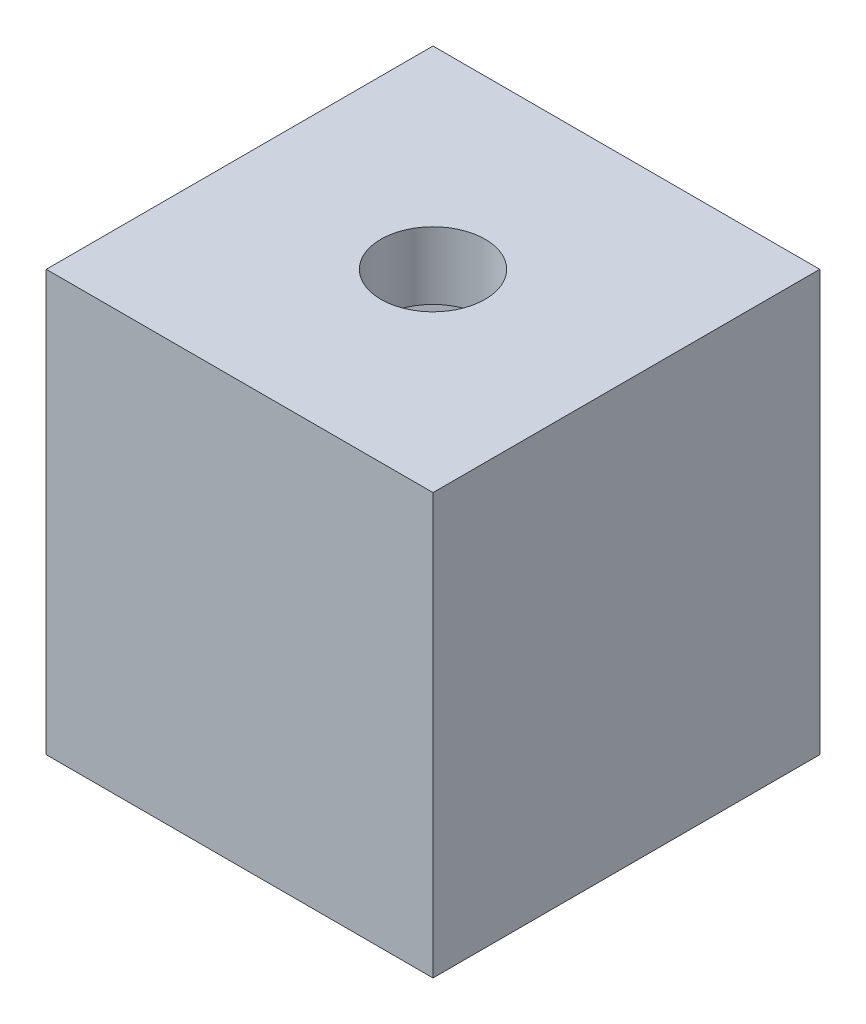
ISO-10303-21;
HEADER;
FILE_DESCRIPTION(('STEP AP214'),'2;1');
FILE_NAME('part.step','',(''),(''),'','','');
FILE_SCHEMA(('AUTOMOTIVE_DESIGN { 1 0 10303 214 1 1 1 1 }'));
ENDSEC;
DATA;
#1=APPLICATION_CONTEXT('core data for automotive mechanical design processes');
#2=APPLICATION_PROTOCOL_DEFINITION('international standard','automotive_design',2000,#1);
#3=PRODUCT_CONTEXT('',#1,'mechanical');
#4=PRODUCT('Part','Part','',(#3));
#5=PRODUCT_RELATED_PRODUCT_CATEGORY('part','',(#4));
#6=PRODUCT_DEFINITION_FORMATION('','',#4);
#7=PRODUCT_DEFINITION_CONTEXT('part definition',#1,'design');
#8=PRODUCT_DEFINITION('design','',#6,#7);
#9=PRODUCT_DEFINITION_SHAPE('','',#8);
#10=(LENGTH_UNIT() NAMED_UNIT(*) SI_UNIT(.MILLI.,.METRE.));
#11=(NAMED_UNIT(*) PLANE_ANGLE_UNIT() SI_UNIT($,.RADIAN.));
#12=(NAMED_UNIT(*) SI_UNIT($,.STERADIAN.) SOLID_ANGLE_UNIT());
#13=UNCERTAINTY_MEASURE_WITH_UNIT(LENGTH_MEASURE(1.E-05),#10,'distance_accuracy_value','');
#14=(GEOMETRIC_REPRESENTATION_CONTEXT(3) GLOBAL_UNCERTAINTY_ASSIGNED_CONTEXT((#13)) GLOBAL_UNIT_ASSIGNED_CONTEXT((#10,
#11,#12)) REPRESENTATION_CONTEXT('',''));
#15=CARTESIAN_POINT('',(0.,0.,0.));
#16=DIRECTION('',(0.,0.,1.));
#17=DIRECTION('',(1.,0.,0.));
#18=AXIS2_PLACEMENT_3D('',#15,#16,#17);
#19=CARTESIAN_POINT('',(-5.75,12.5,-5.75));
#20=DIRECTION('',(0.,0.,-1.));
#21=DIRECTION('',(-1.,0.,0.));
#22=AXIS2_PLACEMENT_3D('',#19,#20,#21);
#23=PLANE('',#22);
#24=DIRECTION('',(1.,0.,0.));
#25=VECTOR('',#24,1.);
#26=CARTESIAN_POINT('',(-5.75,0.,-5.75));
#27=LINE('',#26,#25);
#28=CARTESIAN_POINT('',(-5.75,0.,-5.75));
#29=VERTEX_POINT('',#28);
#30=CARTESIAN_POINT('',(5.75,0.,-5.75));
#31=VERTEX_POINT('',#30);
#32=EDGE_CURVE('E167',#29,#31,#27,.T.);
#33=ORIENTED_EDGE('',*,*,#32,.F.);
#34=DIRECTION('',(0.,-1.,0.));
#35=VECTOR('',#34,1.);
#36=CARTESIAN_POINT('',(-5.75,12.5,-5.75));
#37=LINE('',#36,#35);
#38=CARTESIAN_POINT('',(-5.75,12.5,-5.75));
#39=VERTEX_POINT('',#38);
#40=EDGE_CURVE('E11',#39,#29,#37,.T.);
#41=ORIENTED_EDGE('',*,*,#40,.F.);
#42=DIRECTION('',(1.,0.,0.));
#43=VECTOR('',#42,1.);
#44=CARTESIAN_POINT('',(-5.75,12.5,-5.75));
#45=LINE('',#44,#43);
#46=CARTESIAN_POINT('',(5.75,12.5,-5.75));
#47=VERTEX_POINT('',#46);
#48=EDGE_CURVE('E170',#39,#47,#45,.T.);
#49=ORIENTED_EDGE('',*,*,#48,.T.);
#50=DIRECTION('',(0.,-1.,0.));
#51=VECTOR('',#50,1.);
#52=CARTESIAN_POINT('',(5.75,12.5,-5.75));
#53=LINE('',#52,#51);
#54=EDGE_CURVE('E42',#47,#31,#53,.T.);
#55=ORIENTED_EDGE('',*,*,#54,.T.);
#56=EDGE_LOOP('',(#33,#41,#49,#55));
#57=FACE_BOUND('',#56,.T.);
#58=ADVANCED_FACE('F39',(#57),#23,.T.);
#59=CARTESIAN_POINT('',(-5.75,12.5,5.75));
#60=DIRECTION('',(-1.,0.,0.));
#61=DIRECTION('',(0.,0.,1.));
#62=AXIS2_PLACEMENT_3D('',#59,#60,#61);
#63=PLANE('',#62);
#64=DIRECTION('',(0.,1.,0.));
#65=VECTOR('',#64,1.);
#66=CARTESIAN_POINT('',(-5.75,0.,-2.65));
#67=LINE('',#66,#65);
#68=CARTESIAN_POINT('',(-5.75,0.,-2.65));
#69=VERTEX_POINT('',#68);
#70=CARTESIAN_POINT('',(-5.75,10.5,-2.65));
#71=VERTEX_POINT('',#70);
#72=EDGE_CURVE('E121',#69,#71,#67,.T.);
#73=ORIENTED_EDGE('',*,*,#72,.T.);
#74=DIRECTION('',(0.,0.,1.));
#75=VECTOR('',#74,1.);
#76=CARTESIAN_POINT('',(-5.75,10.5,2.65));
#77=LINE('',#76,#75);
#78=CARTESIAN_POINT('',(-5.75,10.5,2.65));
#79=VERTEX_POINT('',#78);
#80=EDGE_CURVE('E130',#71,#79,#77,.T.);
#81=ORIENTED_EDGE('',*,*,#80,.T.);
#82=DIRECTION('',(0.,-1.,0.));
#83=VECTOR('',#82,1.);
#84=CARTESIAN_POINT('',(-5.75,0.,2.65));
#85=LINE('',#84,#83);
#86=CARTESIAN_POINT('',(-5.75,0.,2.65));
#87=VERTEX_POINT('',#86);
#88=EDGE_CURVE('E137',#79,#87,#85,.T.);
#89=ORIENTED_EDGE('',*,*,#88,.T.);
#90=DIRECTION('',(0.,0.,-1.));
#91=VECTOR('',#90,1.);
#92=CARTESIAN_POINT('',(-5.75,0.,5.75));
#93=LINE('',#92,#91);
#94=CARTESIAN_POINT('',(-5.75,0.,5.75));
#95=VERTEX_POINT('',#94);
#96=EDGE_CURVE('E172',#95,#87,#93,.T.);
#97=ORIENTED_EDGE('',*,*,#96,.F.);
#98=DIRECTION('',(0.,-1.,0.));
#99=VECTOR('',#98,1.);
#100=CARTESIAN_POINT('',(-5.75,12.5,5.75));
#101=LINE('',#100,#99);
#102=CARTESIAN_POINT('',(-5.75,12.5,5.75));
#103=VERTEX_POINT('',#102);
#104=EDGE_CURVE('E47',#103,#95,#101,.T.);
#105=ORIENTED_EDGE('',*,*,#104,.F.);
#106=DIRECTION('',(0.,0.,-1.));
#107=VECTOR('',#106,1.);
#108=CARTESIAN_POINT('',(-5.75,12.5,5.75));
#109=LINE('',#108,#107);
#110=EDGE_CURVE('E176',#103,#39,#109,.T.);
#111=ORIENTED_EDGE('',*,*,#110,.T.);
#112=ORIENTED_EDGE('',*,*,#40,.T.);
#113=EDGE_CURVE('E84',#69,#29,#93,.T.);
#114=ORIENTED_EDGE('',*,*,#113,.F.);
#115=EDGE_LOOP('',(#73,#81,#89,#97,#105,#111,#112,#114));
#116=FACE_BOUND('',#115,.T.);
#117=ADVANCED_FACE('F139',(#116),#63,.T.);
#118=CARTESIAN_POINT('',(-5.75,12.5,5.75));
#119=DIRECTION('',(0.,0.,-1.));
#120=DIRECTION('',(-1.,0.,0.));
#121=AXIS2_PLACEMENT_3D('',#118,#119,#120);
#122=PLANE('',#121);
#123=DIRECTION('',(1.,0.,0.));
#124=VECTOR('',#123,1.);
#125=CARTESIAN_POINT('',(-5.75,0.,5.75));
#126=LINE('',#125,#124);
#127=CARTESIAN_POINT('',(5.75,0.,5.75));
#128=VERTEX_POINT('',#127);
#129=EDGE_CURVE('E183',#95,#128,#126,.T.);
#130=ORIENTED_EDGE('',*,*,#129,.T.);
#131=DIRECTION('',(0.,-1.,0.));
#132=VECTOR('',#131,1.);
#133=CARTESIAN_POINT('',(5.75,12.5,5.75));
#134=LINE('',#133,#132);
#135=CARTESIAN_POINT('',(5.75,12.5,5.75));
#136=VERTEX_POINT('',#135);
#137=EDGE_CURVE('E187',#136,#128,#134,.T.);
#138=ORIENTED_EDGE('',*,*,#137,.F.);
#139=DIRECTION('',(1.,0.,0.));
#140=VECTOR('',#139,1.);
#141=CARTESIAN_POINT('',(-5.75,12.5,5.75));
#142=LINE('',#141,#140);
#143=EDGE_CURVE('E174',#103,#136,#142,.T.);
#144=ORIENTED_EDGE('',*,*,#143,.F.);
#145=ORIENTED_EDGE('',*,*,#104,.T.);
#146=EDGE_LOOP('',(#130,#138,#144,#145));
#147=FACE_BOUND('',#146,.T.);
#148=ADVANCED_FACE('F213',(#147),#122,.F.);
#149=CARTESIAN_POINT('',(5.75,12.5,5.75));
#150=DIRECTION('',(-1.,0.,0.));
#151=DIRECTION('',(0.,0.,1.));
#152=AXIS2_PLACEMENT_3D('',#149,#150,#151);
#153=PLANE('',#152);
#154=DIRECTION('',(0.,0.,-1.));
#155=VECTOR('',#154,1.);
#156=CARTESIAN_POINT('',(5.75,0.,5.75));
#157=LINE('',#156,#155);
#158=EDGE_CURVE('E180',#128,#31,#157,.T.);
#159=ORIENTED_EDGE('',*,*,#158,.T.);
#160=ORIENTED_EDGE('',*,*,#54,.F.);
#161=DIRECTION('',(0.,0.,-1.));
#162=VECTOR('',#161,1.);
#163=CARTESIAN_POINT('',(5.75,12.5,5.75));
#164=LINE('',#163,#162);
#165=EDGE_CURVE('E90',#136,#47,#164,.T.);
#166=ORIENTED_EDGE('',*,*,#165,.F.);
#167=ORIENTED_EDGE('',*,*,#137,.T.);
#168=EDGE_LOOP('',(#159,#160,#166,#167));
#169=FACE_BOUND('',#168,.T.);
#170=ADVANCED_FACE('F192',(#169),#153,.F.);
#171=CARTESIAN_POINT('',(0.,12.5,0.));
#172=DIRECTION('',(0.,1.,0.));
#173=DIRECTION('',(0.,0.,1.));
#174=AXIS2_PLACEMENT_3D('',#171,#172,#173);
#175=PLANE('',#174);
#176=CARTESIAN_POINT('',(0.,12.5,0.));
#177=DIRECTION('',(0.,1.,0.));
#178=DIRECTION('',(0.,0.,1.));
#179=AXIS2_PLACEMENT_3D('',#176,#177,#178);
#180=CIRCLE('',#179,1.55);
#181=CARTESIAN_POINT('',(0.,12.5,1.55));
#182=VERTEX_POINT('',#181);
#183=EDGE_CURVE('E164',#182,#182,#180,.T.);
#184=ORIENTED_EDGE('',*,*,#183,.F.);
#185=EDGE_LOOP('',(#184));
#186=FACE_BOUND('',#185,.T.);
#187=ORIENTED_EDGE('',*,*,#48,.F.);
#188=ORIENTED_EDGE('',*,*,#110,.F.);
#189=ORIENTED_EDGE('',*,*,#143,.T.);
#190=ORIENTED_EDGE('',*,*,#165,.T.);
#191=EDGE_LOOP('',(#187,#188,#189,#190));
#192=FACE_BOUND('',#191,.T.);
#193=ADVANCED_FACE('F197',(#186,#192),#175,.T.);
#194=CARTESIAN_POINT('',(0.,0.,0.));
#195=DIRECTION('',(0.,1.,0.));
#196=DIRECTION('',(0.,0.,1.));
#197=AXIS2_PLACEMENT_3D('',#194,#195,#196);
#198=PLANE('',#197);
#199=DIRECTION('',(-1.,0.,0.));
#200=VECTOR('',#199,1.);
#201=CARTESIAN_POINT('',(1.52997821335251,0.,-2.65));
#202=LINE('',#201,#200);
#203=CARTESIAN_POINT('',(1.52997821335251,0.,-2.65));
#204=VERTEX_POINT('',#203);
#205=EDGE_CURVE('E55',#204,#69,#202,.T.);
#206=ORIENTED_EDGE('',*,*,#205,.T.);
#207=ORIENTED_EDGE('',*,*,#113,.T.);
#208=ORIENTED_EDGE('',*,*,#32,.T.);
#209=ORIENTED_EDGE('',*,*,#158,.F.);
#210=ORIENTED_EDGE('',*,*,#129,.F.);
#211=ORIENTED_EDGE('',*,*,#96,.T.);
#212=DIRECTION('',(1.,0.,0.));
#213=VECTOR('',#212,1.);
#214=CARTESIAN_POINT('',(-1.52997821335251,0.,2.65));
#215=LINE('',#214,#213);
#216=CARTESIAN_POINT('',(1.52997821335251,0.,2.65));
#217=VERTEX_POINT('',#216);
#218=EDGE_CURVE('E151',#87,#217,#215,.T.);
#219=ORIENTED_EDGE('',*,*,#218,.T.);
#220=DIRECTION('',(0.5,0.,-0.866025403784439));
#221=VECTOR('',#220,1.);
#222=CARTESIAN_POINT('',(1.52997821335251,0.,2.65));
#223=LINE('',#222,#221);
#224=CARTESIAN_POINT('',(3.05995642670502,0.,0.));
#225=VERTEX_POINT('',#224);
#226=EDGE_CURVE('E144',#217,#225,#223,.T.);
#227=ORIENTED_EDGE('',*,*,#226,.T.);
#228=DIRECTION('',(-0.5,0.,-0.866025403784438));
#229=VECTOR('',#228,1.);
#230=CARTESIAN_POINT('',(3.05995642670502,0.,0.));
#231=LINE('',#230,#229);
#232=EDGE_CURVE('E147',#225,#204,#231,.T.);
#233=ORIENTED_EDGE('',*,*,#232,.T.);
#234=EDGE_LOOP('',(#206,#207,#208,#209,#210,#211,#219,#227,#233));
#235=FACE_BOUND('',#234,.T.);
#236=ADVANCED_FACE('F194',(#235),#198,.F.);
#237=CARTESIAN_POINT('',(0.,12.5,0.));
#238=DIRECTION('',(0.,-1.,0.));
#239=DIRECTION('',(0.,0.,-1.));
#240=AXIS2_PLACEMENT_3D('',#237,#238,#239);
#241=CYLINDRICAL_SURFACE('',#240,1.55);
#242=ORIENTED_EDGE('',*,*,#183,.T.);
#243=EDGE_LOOP('',(#242));
#244=FACE_BOUND('',#243,.T.);
#245=CARTESIAN_POINT('',(0.,10.5,0.));
#246=DIRECTION('',(0.,1.,0.));
#247=DIRECTION('',(0.,0.,1.));
#248=AXIS2_PLACEMENT_3D('',#245,#246,#247);
#249=CIRCLE('',#248,1.55);
#250=CARTESIAN_POINT('',(0.,10.5,1.55));
#251=VERTEX_POINT('',#250);
#252=EDGE_CURVE('E161',#251,#251,#249,.T.);
#253=ORIENTED_EDGE('',*,*,#252,.F.);
#254=EDGE_LOOP('',(#253));
#255=FACE_BOUND('',#254,.T.);
#256=ADVANCED_FACE('F196',(#244,#255),#241,.F.);
#257=CARTESIAN_POINT('',(1.52997821335251,0.,2.65));
#258=DIRECTION('',(0.866025403784439,0.,0.5));
#259=DIRECTION('',(0.5,0.,-0.866025403784439));
#260=AXIS2_PLACEMENT_3D('',#257,#258,#259);
#261=PLANE('',#260);
#262=DIRECTION('',(0.5,0.,-0.866025403784439));
#263=VECTOR('',#262,1.);
#264=CARTESIAN_POINT('',(1.52997821335251,10.5,2.65));
#265=LINE('',#264,#263);
#266=CARTESIAN_POINT('',(1.52997821335251,10.5,2.65));
#267=VERTEX_POINT('',#266);
#268=CARTESIAN_POINT('',(3.05995642670502,10.5,0.));
#269=VERTEX_POINT('',#268);
#270=EDGE_CURVE('E143',#267,#269,#265,.T.);
#271=ORIENTED_EDGE('',*,*,#270,.T.);
#272=DIRECTION('',(0.,1.,0.));
#273=VECTOR('',#272,1.);
#274=CARTESIAN_POINT('',(3.05995642670502,0.,0.));
#275=LINE('',#274,#273);
#276=EDGE_CURVE('E153',#225,#269,#275,.T.);
#277=ORIENTED_EDGE('',*,*,#276,.F.);
#278=ORIENTED_EDGE('',*,*,#226,.F.);
#279=DIRECTION('',(0.,1.,0.));
#280=VECTOR('',#279,1.);
#281=CARTESIAN_POINT('',(1.52997821335251,0.,2.65));
#282=LINE('',#281,#280);
#283=EDGE_CURVE('E158',#217,#267,#282,.T.);
#284=ORIENTED_EDGE('',*,*,#283,.T.);
#285=EDGE_LOOP('',(#271,#277,#278,#284));
#286=FACE_BOUND('',#285,.T.);
#287=ADVANCED_FACE('F203',(#286),#261,.F.);
#288=CARTESIAN_POINT('',(-1.52997821335251,0.,2.65));
#289=DIRECTION('',(0.,0.,1.));
#290=DIRECTION('',(1.,0.,0.));
#291=AXIS2_PLACEMENT_3D('',#288,#289,#290);
#292=PLANE('',#291);
#293=DIRECTION('',(1.,0.,0.));
#294=VECTOR('',#293,1.);
#295=CARTESIAN_POINT('',(-1.52997821335251,10.5,2.65));
#296=LINE('',#295,#294);
#297=EDGE_CURVE('E126',#79,#267,#296,.T.);
#298=ORIENTED_EDGE('',*,*,#297,.T.);
#299=ORIENTED_EDGE('',*,*,#283,.F.);
#300=ORIENTED_EDGE('',*,*,#218,.F.);
#301=ORIENTED_EDGE('',*,*,#88,.F.);
#302=EDGE_LOOP('',(#298,#299,#300,#301));
#303=FACE_BOUND('',#302,.T.);
#304=ADVANCED_FACE('F239',(#303),#292,.F.);
#305=CARTESIAN_POINT('',(1.52997821335251,0.,-2.65));
#306=DIRECTION('',(0.,0.,-1.));
#307=DIRECTION('',(-1.,0.,0.));
#308=AXIS2_PLACEMENT_3D('',#305,#306,#307);
#309=PLANE('',#308);
#310=ORIENTED_EDGE('',*,*,#72,.F.);
#311=ORIENTED_EDGE('',*,*,#205,.F.);
#312=DIRECTION('',(0.,1.,0.));
#313=VECTOR('',#312,1.);
#314=CARTESIAN_POINT('',(1.52997821335251,0.,-2.65));
#315=LINE('',#314,#313);
#316=CARTESIAN_POINT('',(1.52997821335251,10.5,-2.65));
#317=VERTEX_POINT('',#316);
#318=EDGE_CURVE('E122',#204,#317,#315,.T.);
#319=ORIENTED_EDGE('',*,*,#318,.T.);
#320=DIRECTION('',(-1.,0.,0.));
#321=VECTOR('',#320,1.);
#322=CARTESIAN_POINT('',(1.52997821335251,10.5,-2.65));
#323=LINE('',#322,#321);
#324=EDGE_CURVE('E117',#317,#71,#323,.T.);
#325=ORIENTED_EDGE('',*,*,#324,.T.);
#326=EDGE_LOOP('',(#310,#311,#319,#325));
#327=FACE_BOUND('',#326,.T.);
#328=ADVANCED_FACE('F119',(#327),#309,.F.);
#329=CARTESIAN_POINT('',(3.05995642670502,0.,0.));
#330=DIRECTION('',(0.866025403784438,0.,-0.5));
#331=DIRECTION('',(-0.5,0.,-0.866025403784439));
#332=AXIS2_PLACEMENT_3D('',#329,#330,#331);
#333=PLANE('',#332);
#334=DIRECTION('',(-0.5,0.,-0.866025403784438));
#335=VECTOR('',#334,1.);
#336=CARTESIAN_POINT('',(3.05995642670502,10.5,0.));
#337=LINE('',#336,#335);
#338=EDGE_CURVE('E127',#269,#317,#337,.T.);
#339=ORIENTED_EDGE('',*,*,#338,.T.);
#340=ORIENTED_EDGE('',*,*,#318,.F.);
#341=ORIENTED_EDGE('',*,*,#232,.F.);
#342=ORIENTED_EDGE('',*,*,#276,.T.);
#343=EDGE_LOOP('',(#339,#340,#341,#342));
#344=FACE_BOUND('',#343,.T.);
#345=ADVANCED_FACE('F249',(#344),#333,.F.);
#346=CARTESIAN_POINT('',(0.,10.5,0.));
#347=DIRECTION('',(0.,1.,0.));
#348=DIRECTION('',(0.,0.,1.));
#349=AXIS2_PLACEMENT_3D('',#346,#347,#348);
#350=PLANE('',#349);
#351=ORIENTED_EDGE('',*,*,#297,.F.);
#352=ORIENTED_EDGE('',*,*,#80,.F.);
#353=ORIENTED_EDGE('',*,*,#324,.F.);
#354=ORIENTED_EDGE('',*,*,#338,.F.);
#355=ORIENTED_EDGE('',*,*,#270,.F.);
#356=EDGE_LOOP('',(#351,#352,#353,#354,#355));
#357=FACE_BOUND('',#356,.T.);
#358=ORIENTED_EDGE('',*,*,#252,.T.);
#359=EDGE_LOOP('',(#358));
#360=FACE_BOUND('',#359,.T.);
#361=ADVANCED_FACE('F131',(#357,#360),#350,.F.);
#362=CLOSED_SHELL('',(#58,#117,#148,#170,#193,#236,#256,#287,#304,#328,#345,#361));
#363=MANIFOLD_SOLID_BREP('B2',#362);
#364=ADVANCED_BREP_SHAPE_REPRESENTATION('',(#18,#363),#14);
#365=SHAPE_DEFINITION_REPRESENTATION(#9,#364);
ENDSEC;
END-ISO-10303-21;
